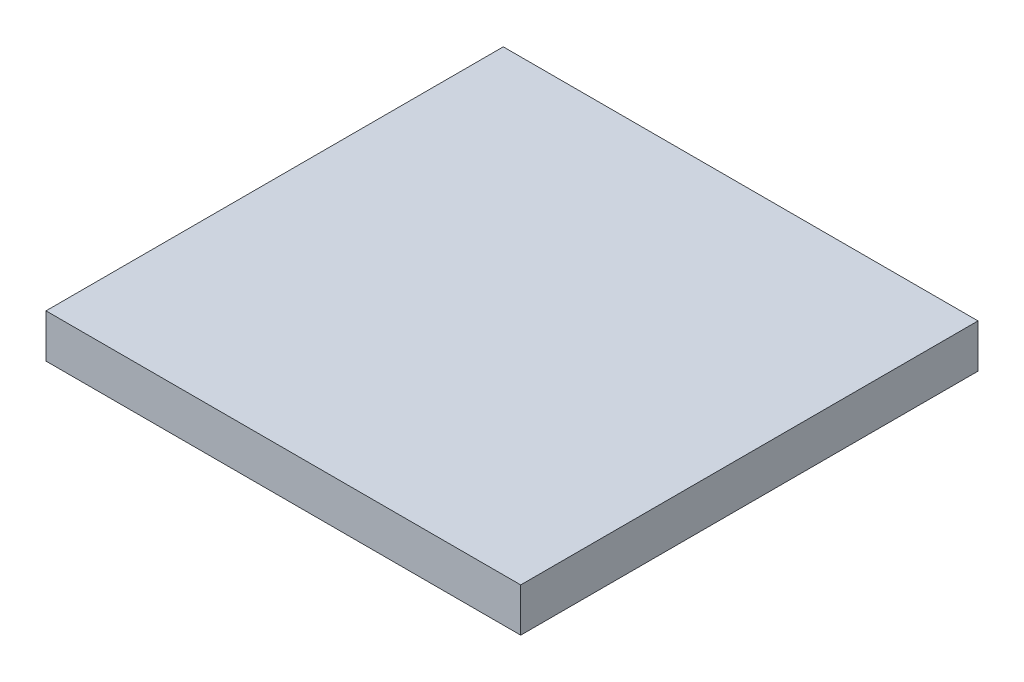
ISO-10303-21;
HEADER;
FILE_DESCRIPTION(('STEP AP214'),'2;1');
FILE_NAME('part.step','',(''),(''),'','','');
FILE_SCHEMA(('AUTOMOTIVE_DESIGN { 1 0 10303 214 1 1 1 1 }'));
ENDSEC;
DATA;
#1=APPLICATION_CONTEXT('core data for automotive mechanical design processes');
#2=APPLICATION_PROTOCOL_DEFINITION('international standard','automotive_design',2000,#1);
#3=PRODUCT_CONTEXT('',#1,'mechanical');
#4=PRODUCT('Part','Part','',(#3));
#5=PRODUCT_RELATED_PRODUCT_CATEGORY('part','',(#4));
#6=PRODUCT_DEFINITION_FORMATION('','',#4);
#7=PRODUCT_DEFINITION_CONTEXT('part definition',#1,'design');
#8=PRODUCT_DEFINITION('design','',#6,#7);
#9=PRODUCT_DEFINITION_SHAPE('','',#8);
#10=(LENGTH_UNIT() NAMED_UNIT(*) SI_UNIT(.MILLI.,.METRE.));
#11=(NAMED_UNIT(*) PLANE_ANGLE_UNIT() SI_UNIT($,.RADIAN.));
#12=(NAMED_UNIT(*) SI_UNIT($,.STERADIAN.) SOLID_ANGLE_UNIT());
#13=UNCERTAINTY_MEASURE_WITH_UNIT(LENGTH_MEASURE(1.E-05),#10,'distance_accuracy_value','');
#14=(GEOMETRIC_REPRESENTATION_CONTEXT(3) GLOBAL_UNCERTAINTY_ASSIGNED_CONTEXT((#13)) GLOBAL_UNIT_ASSIGNED_CONTEXT((#10,
#11,#12)) REPRESENTATION_CONTEXT('',''));
#15=CARTESIAN_POINT('',(0.,0.,0.));
#16=DIRECTION('',(0.,0.,1.));
#17=DIRECTION('',(1.,0.,0.));
#18=AXIS2_PLACEMENT_3D('',#15,#16,#17);
#19=CARTESIAN_POINT('',(13.843,2.53999999999999,13.335));
#20=DIRECTION('',(-1.,0.,0.));
#21=DIRECTION('',(0.,0.,1.));
#22=AXIS2_PLACEMENT_3D('',#19,#20,#21);
#23=PLANE('',#22);
#24=DIRECTION('',(0.,0.,-1.));
#25=VECTOR('',#24,1.);
#26=CARTESIAN_POINT('',(13.843,0.,13.335));
#27=LINE('',#26,#25);
#28=CARTESIAN_POINT('',(13.843,0.,13.335));
#29=VERTEX_POINT('',#28);
#30=CARTESIAN_POINT('',(13.843,0.,-13.335));
#31=VERTEX_POINT('',#30);
#32=EDGE_CURVE('E105',#29,#31,#27,.T.);
#33=ORIENTED_EDGE('',*,*,#32,.T.);
#34=DIRECTION('',(0.,-1.,0.));
#35=VECTOR('',#34,1.);
#36=CARTESIAN_POINT('',(13.843,2.53999999999999,-13.335));
#37=LINE('',#36,#35);
#38=CARTESIAN_POINT('',(13.843,2.53999999999999,-13.335));
#39=VERTEX_POINT('',#38);
#40=EDGE_CURVE('E11',#39,#31,#37,.T.);
#41=ORIENTED_EDGE('',*,*,#40,.F.);
#42=DIRECTION('',(0.,0.,-1.));
#43=VECTOR('',#42,1.);
#44=CARTESIAN_POINT('',(13.843,2.53999999999999,13.335));
#45=LINE('',#44,#43);
#46=CARTESIAN_POINT('',(13.843,2.53999999999999,13.335));
#47=VERTEX_POINT('',#46);
#48=EDGE_CURVE('E88',#47,#39,#45,.T.);
#49=ORIENTED_EDGE('',*,*,#48,.F.);
#50=DIRECTION('',(0.,-1.,0.));
#51=VECTOR('',#50,1.);
#52=CARTESIAN_POINT('',(13.843,2.53999999999999,13.335));
#53=LINE('',#52,#51);
#54=EDGE_CURVE('E101',#47,#29,#53,.T.);
#55=ORIENTED_EDGE('',*,*,#54,.T.);
#56=EDGE_LOOP('',(#33,#41,#49,#55));
#57=FACE_BOUND('',#56,.T.);
#58=ADVANCED_FACE('F36',(#57),#23,.F.);
#59=CARTESIAN_POINT('',(-13.843,2.53999999999999,-13.335));
#60=DIRECTION('',(0.,0.,1.));
#61=DIRECTION('',(1.,0.,0.));
#62=AXIS2_PLACEMENT_3D('',#59,#60,#61);
#63=PLANE('',#62);
#64=DIRECTION('',(-1.,0.,0.));
#65=VECTOR('',#64,1.);
#66=CARTESIAN_POINT('',(-13.843,0.,-13.335));
#67=LINE('',#66,#65);
#68=CARTESIAN_POINT('',(-13.843,0.,-13.335));
#69=VERTEX_POINT('',#68);
#70=EDGE_CURVE('E93',#31,#69,#67,.T.);
#71=ORIENTED_EDGE('',*,*,#70,.T.);
#72=DIRECTION('',(0.,-1.,0.));
#73=VECTOR('',#72,1.);
#74=CARTESIAN_POINT('',(-13.843,2.53999999999999,-13.335));
#75=LINE('',#74,#73);
#76=CARTESIAN_POINT('',(-13.843,2.53999999999999,-13.335));
#77=VERTEX_POINT('',#76);
#78=EDGE_CURVE('E45',#77,#69,#75,.T.);
#79=ORIENTED_EDGE('',*,*,#78,.F.);
#80=DIRECTION('',(-1.,0.,0.));
#81=VECTOR('',#80,1.);
#82=CARTESIAN_POINT('',(-13.843,2.53999999999999,-13.335));
#83=LINE('',#82,#81);
#84=EDGE_CURVE('E83',#39,#77,#83,.T.);
#85=ORIENTED_EDGE('',*,*,#84,.F.);
#86=ORIENTED_EDGE('',*,*,#40,.T.);
#87=EDGE_LOOP('',(#71,#79,#85,#86));
#88=FACE_BOUND('',#87,.T.);
#89=ADVANCED_FACE('F92',(#88),#63,.F.);
#90=CARTESIAN_POINT('',(-13.843,2.53999999999999,13.335));
#91=DIRECTION('',(1.,0.,0.));
#92=DIRECTION('',(0.,0.,-1.));
#93=AXIS2_PLACEMENT_3D('',#90,#91,#92);
#94=PLANE('',#93);
#95=DIRECTION('',(0.,0.,1.));
#96=VECTOR('',#95,1.);
#97=CARTESIAN_POINT('',(-13.843,0.,13.335));
#98=LINE('',#97,#96);
#99=CARTESIAN_POINT('',(-13.843,0.,13.335));
#100=VERTEX_POINT('',#99);
#101=EDGE_CURVE('E70',#69,#100,#98,.T.);
#102=ORIENTED_EDGE('',*,*,#101,.T.);
#103=DIRECTION('',(0.,-1.,0.));
#104=VECTOR('',#103,1.);
#105=CARTESIAN_POINT('',(-13.843,2.53999999999999,13.335));
#106=LINE('',#105,#104);
#107=CARTESIAN_POINT('',(-13.843,2.53999999999999,13.335));
#108=VERTEX_POINT('',#107);
#109=EDGE_CURVE('E95',#108,#100,#106,.T.);
#110=ORIENTED_EDGE('',*,*,#109,.F.);
#111=DIRECTION('',(0.,0.,1.));
#112=VECTOR('',#111,1.);
#113=CARTESIAN_POINT('',(-13.843,2.53999999999999,13.335));
#114=LINE('',#113,#112);
#115=EDGE_CURVE('E86',#77,#108,#114,.T.);
#116=ORIENTED_EDGE('',*,*,#115,.F.);
#117=ORIENTED_EDGE('',*,*,#78,.T.);
#118=EDGE_LOOP('',(#102,#110,#116,#117));
#119=FACE_BOUND('',#118,.T.);
#120=ADVANCED_FACE('F96',(#119),#94,.F.);
#121=CARTESIAN_POINT('',(-13.843,2.53999999999999,13.335));
#122=DIRECTION('',(0.,0.,-1.));
#123=DIRECTION('',(-1.,0.,0.));
#124=AXIS2_PLACEMENT_3D('',#121,#122,#123);
#125=PLANE('',#124);
#126=DIRECTION('',(1.,0.,0.));
#127=VECTOR('',#126,1.);
#128=CARTESIAN_POINT('',(-13.843,0.,13.335));
#129=LINE('',#128,#127);
#130=EDGE_CURVE('E76',#100,#29,#129,.T.);
#131=ORIENTED_EDGE('',*,*,#130,.T.);
#132=ORIENTED_EDGE('',*,*,#54,.F.);
#133=DIRECTION('',(1.,0.,0.));
#134=VECTOR('',#133,1.);
#135=CARTESIAN_POINT('',(-13.843,2.53999999999999,13.335));
#136=LINE('',#135,#134);
#137=EDGE_CURVE('E53',#108,#47,#136,.T.);
#138=ORIENTED_EDGE('',*,*,#137,.F.);
#139=ORIENTED_EDGE('',*,*,#109,.T.);
#140=EDGE_LOOP('',(#131,#132,#138,#139));
#141=FACE_BOUND('',#140,.T.);
#142=ADVANCED_FACE('F119',(#141),#125,.F.);
#143=CARTESIAN_POINT('',(0.,2.53999999999999,0.));
#144=DIRECTION('',(0.,-1.,0.));
#145=DIRECTION('',(0.,0.,-1.));
#146=AXIS2_PLACEMENT_3D('',#143,#144,#145);
#147=PLANE('',#146);
#148=ORIENTED_EDGE('',*,*,#48,.T.);
#149=ORIENTED_EDGE('',*,*,#84,.T.);
#150=ORIENTED_EDGE('',*,*,#115,.T.);
#151=ORIENTED_EDGE('',*,*,#137,.T.);
#152=EDGE_LOOP('',(#148,#149,#150,#151));
#153=FACE_BOUND('',#152,.T.);
#154=ADVANCED_FACE('F84',(#153),#147,.F.);
#155=CARTESIAN_POINT('',(0.,0.,0.));
#156=DIRECTION('',(0.,-1.,0.));
#157=DIRECTION('',(0.,0.,-1.));
#158=AXIS2_PLACEMENT_3D('',#155,#156,#157);
#159=PLANE('',#158);
#160=ORIENTED_EDGE('',*,*,#32,.F.);
#161=ORIENTED_EDGE('',*,*,#130,.F.);
#162=ORIENTED_EDGE('',*,*,#101,.F.);
#163=ORIENTED_EDGE('',*,*,#70,.F.);
#164=EDGE_LOOP('',(#160,#161,#162,#163));
#165=FACE_BOUND('',#164,.T.);
#166=ADVANCED_FACE('F122',(#165),#159,.T.);
#167=CLOSED_SHELL('',(#58,#89,#120,#142,#154,#166));
#168=MANIFOLD_SOLID_BREP('B2',#167);
#169=ADVANCED_BREP_SHAPE_REPRESENTATION('',(#18,#168),#14);
#170=SHAPE_DEFINITION_REPRESENTATION(#9,#169);
ENDSEC;
END-ISO-10303-21;
